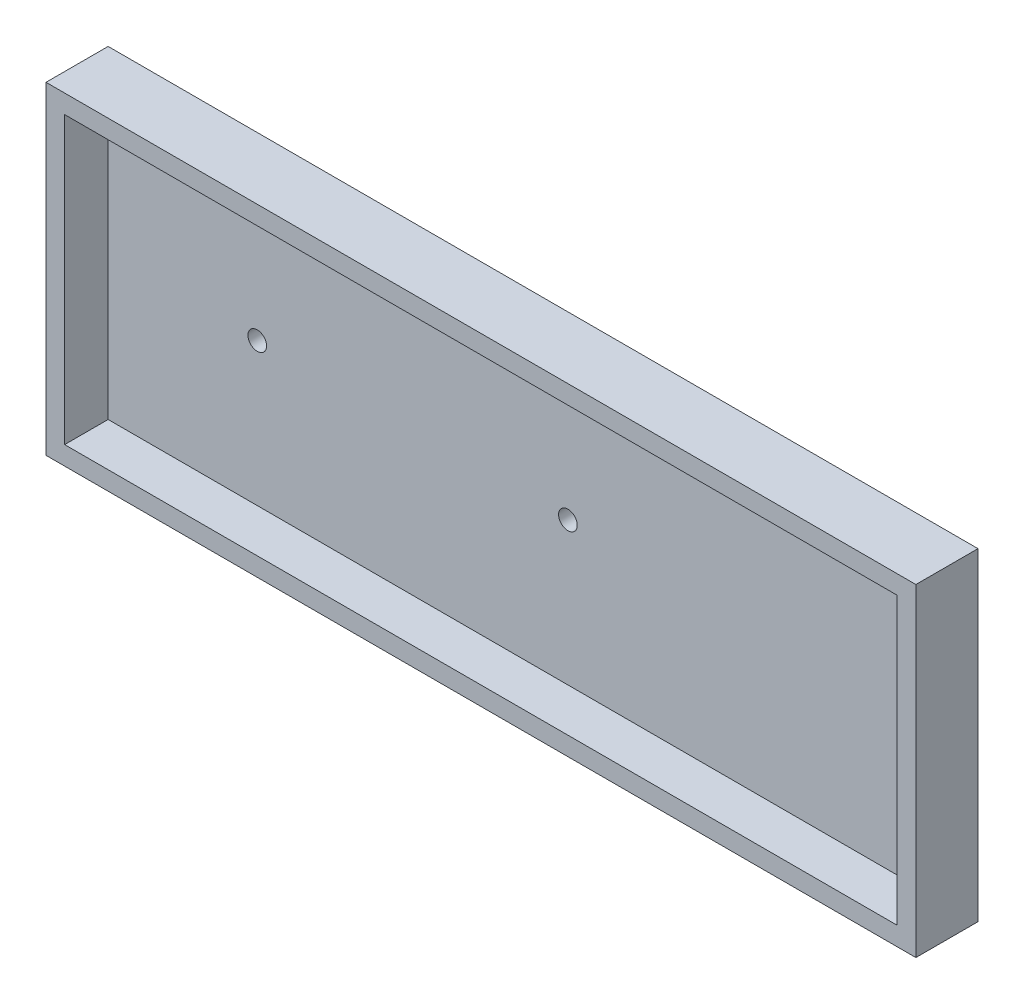
ISO-10303-21;
HEADER;
FILE_DESCRIPTION(('STEP AP214'),'2;1');
FILE_NAME('part.step','',(''),(''),'','','');
FILE_SCHEMA(('AUTOMOTIVE_DESIGN { 1 0 10303 214 1 1 1 1 }'));
ENDSEC;
DATA;
#1=APPLICATION_CONTEXT('core data for automotive mechanical design processes');
#2=APPLICATION_PROTOCOL_DEFINITION('international standard','automotive_design',2000,#1);
#3=PRODUCT_CONTEXT('',#1,'mechanical');
#4=PRODUCT('Part','Part','',(#3));
#5=PRODUCT_RELATED_PRODUCT_CATEGORY('part','',(#4));
#6=PRODUCT_DEFINITION_FORMATION('','',#4);
#7=PRODUCT_DEFINITION_CONTEXT('part definition',#1,'design');
#8=PRODUCT_DEFINITION('design','',#6,#7);
#9=PRODUCT_DEFINITION_SHAPE('','',#8);
#10=(LENGTH_UNIT() NAMED_UNIT(*) SI_UNIT(.MILLI.,.METRE.));
#11=(NAMED_UNIT(*) PLANE_ANGLE_UNIT() SI_UNIT($,.RADIAN.));
#12=(NAMED_UNIT(*) SI_UNIT($,.STERADIAN.) SOLID_ANGLE_UNIT());
#13=UNCERTAINTY_MEASURE_WITH_UNIT(LENGTH_MEASURE(1.E-05),#10,'distance_accuracy_value','');
#14=(GEOMETRIC_REPRESENTATION_CONTEXT(3) GLOBAL_UNCERTAINTY_ASSIGNED_CONTEXT((#13)) GLOBAL_UNIT_ASSIGNED_CONTEXT((#10,
#11,#12)) REPRESENTATION_CONTEXT('',''));
#15=CARTESIAN_POINT('',(0.,0.,0.));
#16=DIRECTION('',(0.,0.,1.));
#17=DIRECTION('',(1.,0.,0.));
#18=AXIS2_PLACEMENT_3D('',#15,#16,#17);
#19=CARTESIAN_POINT('',(0.,0.,5.));
#20=DIRECTION('',(0.,0.,-1.));
#21=DIRECTION('',(-1.,0.,0.));
#22=AXIS2_PLACEMENT_3D('',#19,#20,#21);
#23=PLANE('',#22);
#24=DIRECTION('',(0.,1.,0.));
#25=VECTOR('',#24,1.);
#26=CARTESIAN_POINT('',(35.,-13.,5.));
#27=LINE('',#26,#25);
#28=CARTESIAN_POINT('',(35.,-13.,5.));
#29=VERTEX_POINT('',#28);
#30=CARTESIAN_POINT('',(35.,13.,5.));
#31=VERTEX_POINT('',#30);
#32=EDGE_CURVE('E157',#29,#31,#27,.T.);
#33=ORIENTED_EDGE('',*,*,#32,.T.);
#34=DIRECTION('',(-1.,0.,0.));
#35=VECTOR('',#34,1.);
#36=CARTESIAN_POINT('',(-35.,13.,5.));
#37=LINE('',#36,#35);
#38=CARTESIAN_POINT('',(-35.,13.,5.));
#39=VERTEX_POINT('',#38);
#40=EDGE_CURVE('E92',#31,#39,#37,.T.);
#41=ORIENTED_EDGE('',*,*,#40,.T.);
#42=DIRECTION('',(0.,-1.,0.));
#43=VECTOR('',#42,1.);
#44=CARTESIAN_POINT('',(-35.,-13.,5.));
#45=LINE('',#44,#43);
#46=CARTESIAN_POINT('',(-35.,-13.,5.));
#47=VERTEX_POINT('',#46);
#48=EDGE_CURVE('E162',#39,#47,#45,.T.);
#49=ORIENTED_EDGE('',*,*,#48,.T.);
#50=DIRECTION('',(1.,0.,0.));
#51=VECTOR('',#50,1.);
#52=CARTESIAN_POINT('',(-35.,-13.,5.));
#53=LINE('',#52,#51);
#54=EDGE_CURVE('E64',#47,#29,#53,.T.);
#55=ORIENTED_EDGE('',*,*,#54,.T.);
#56=EDGE_LOOP('',(#33,#41,#49,#55));
#57=FACE_BOUND('',#56,.T.);
#58=DIRECTION('',(0.,1.,0.));
#59=VECTOR('',#58,1.);
#60=CARTESIAN_POINT('',(33.5,0.,5.));
#61=LINE('',#60,#59);
#62=CARTESIAN_POINT('',(33.5,-11.5,5.));
#63=VERTEX_POINT('',#62);
#64=CARTESIAN_POINT('',(33.5,11.5,5.));
#65=VERTEX_POINT('',#64);
#66=EDGE_CURVE('E141',#63,#65,#61,.T.);
#67=ORIENTED_EDGE('',*,*,#66,.F.);
#68=DIRECTION('',(1.,0.,0.));
#69=VECTOR('',#68,1.);
#70=CARTESIAN_POINT('',(0.,-11.5,5.));
#71=LINE('',#70,#69);
#72=CARTESIAN_POINT('',(-33.5,-11.5,5.));
#73=VERTEX_POINT('',#72);
#74=EDGE_CURVE('E154',#73,#63,#71,.T.);
#75=ORIENTED_EDGE('',*,*,#74,.F.);
#76=DIRECTION('',(0.,-1.,0.));
#77=VECTOR('',#76,1.);
#78=CARTESIAN_POINT('',(-33.5,0.,5.));
#79=LINE('',#78,#77);
#80=CARTESIAN_POINT('',(-33.5,11.5,5.));
#81=VERTEX_POINT('',#80);
#82=EDGE_CURVE('E151',#81,#73,#79,.T.);
#83=ORIENTED_EDGE('',*,*,#82,.F.);
#84=DIRECTION('',(-1.,0.,0.));
#85=VECTOR('',#84,1.);
#86=CARTESIAN_POINT('',(0.,11.5,5.));
#87=LINE('',#86,#85);
#88=EDGE_CURVE('E130',#65,#81,#87,.T.);
#89=ORIENTED_EDGE('',*,*,#88,.F.);
#90=EDGE_LOOP('',(#67,#75,#83,#89));
#91=FACE_BOUND('',#90,.T.);
#92=ADVANCED_FACE('F39',(#57,#91),#23,.F.);
#93=CARTESIAN_POINT('',(35.,-13.,5.));
#94=DIRECTION('',(-1.,0.,0.));
#95=DIRECTION('',(0.,0.,1.));
#96=AXIS2_PLACEMENT_3D('',#93,#94,#95);
#97=PLANE('',#96);
#98=DIRECTION('',(0.,1.,0.));
#99=VECTOR('',#98,1.);
#100=CARTESIAN_POINT('',(35.,-13.,0.));
#101=LINE('',#100,#99);
#102=CARTESIAN_POINT('',(35.,-13.,0.));
#103=VERTEX_POINT('',#102);
#104=CARTESIAN_POINT('',(35.,13.,0.));
#105=VERTEX_POINT('',#104);
#106=EDGE_CURVE('E168',#103,#105,#101,.T.);
#107=ORIENTED_EDGE('',*,*,#106,.T.);
#108=DIRECTION('',(0.,0.,-1.));
#109=VECTOR('',#108,1.);
#110=CARTESIAN_POINT('',(35.,13.,5.));
#111=LINE('',#110,#109);
#112=EDGE_CURVE('E11',#31,#105,#111,.T.);
#113=ORIENTED_EDGE('',*,*,#112,.F.);
#114=ORIENTED_EDGE('',*,*,#32,.F.);
#115=DIRECTION('',(0.,0.,-1.));
#116=VECTOR('',#115,1.);
#117=CARTESIAN_POINT('',(35.,-13.,5.));
#118=LINE('',#117,#116);
#119=EDGE_CURVE('E167',#29,#103,#118,.T.);
#120=ORIENTED_EDGE('',*,*,#119,.T.);
#121=EDGE_LOOP('',(#107,#113,#114,#120));
#122=FACE_BOUND('',#121,.T.);
#123=ADVANCED_FACE('F41',(#122),#97,.F.);
#124=CARTESIAN_POINT('',(-35.,13.,5.));
#125=DIRECTION('',(0.,-1.,0.));
#126=DIRECTION('',(0.,0.,-1.));
#127=AXIS2_PLACEMENT_3D('',#124,#125,#126);
#128=PLANE('',#127);
#129=DIRECTION('',(-1.,0.,0.));
#130=VECTOR('',#129,1.);
#131=CARTESIAN_POINT('',(-35.,13.,0.));
#132=LINE('',#131,#130);
#133=CARTESIAN_POINT('',(-35.,13.,0.));
#134=VERTEX_POINT('',#133);
#135=EDGE_CURVE('E172',#105,#134,#132,.T.);
#136=ORIENTED_EDGE('',*,*,#135,.T.);
#137=DIRECTION('',(0.,0.,-1.));
#138=VECTOR('',#137,1.);
#139=CARTESIAN_POINT('',(-35.,13.,5.));
#140=LINE('',#139,#138);
#141=EDGE_CURVE('E48',#39,#134,#140,.T.);
#142=ORIENTED_EDGE('',*,*,#141,.F.);
#143=ORIENTED_EDGE('',*,*,#40,.F.);
#144=ORIENTED_EDGE('',*,*,#112,.T.);
#145=EDGE_LOOP('',(#136,#142,#143,#144));
#146=FACE_BOUND('',#145,.T.);
#147=ADVANCED_FACE('F207',(#146),#128,.F.);
#148=CARTESIAN_POINT('',(-35.,-13.,5.));
#149=DIRECTION('',(1.,0.,0.));
#150=DIRECTION('',(0.,0.,-1.));
#151=AXIS2_PLACEMENT_3D('',#148,#149,#150);
#152=PLANE('',#151);
#153=DIRECTION('',(0.,-1.,0.));
#154=VECTOR('',#153,1.);
#155=CARTESIAN_POINT('',(-35.,-13.,0.));
#156=LINE('',#155,#154);
#157=CARTESIAN_POINT('',(-35.,-13.,0.));
#158=VERTEX_POINT('',#157);
#159=EDGE_CURVE('E175',#134,#158,#156,.T.);
#160=ORIENTED_EDGE('',*,*,#159,.T.);
#161=DIRECTION('',(0.,0.,-1.));
#162=VECTOR('',#161,1.);
#163=CARTESIAN_POINT('',(-35.,-13.,5.));
#164=LINE('',#163,#162);
#165=EDGE_CURVE('E182',#47,#158,#164,.T.);
#166=ORIENTED_EDGE('',*,*,#165,.F.);
#167=ORIENTED_EDGE('',*,*,#48,.F.);
#168=ORIENTED_EDGE('',*,*,#141,.T.);
#169=EDGE_LOOP('',(#160,#166,#167,#168));
#170=FACE_BOUND('',#169,.T.);
#171=ADVANCED_FACE('F189',(#170),#152,.F.);
#172=CARTESIAN_POINT('',(-35.,-13.,5.));
#173=DIRECTION('',(0.,1.,0.));
#174=DIRECTION('',(0.,0.,1.));
#175=AXIS2_PLACEMENT_3D('',#172,#173,#174);
#176=PLANE('',#175);
#177=DIRECTION('',(1.,0.,0.));
#178=VECTOR('',#177,1.);
#179=CARTESIAN_POINT('',(-35.,-13.,0.));
#180=LINE('',#179,#178);
#181=EDGE_CURVE('E85',#158,#103,#180,.T.);
#182=ORIENTED_EDGE('',*,*,#181,.T.);
#183=ORIENTED_EDGE('',*,*,#119,.F.);
#184=ORIENTED_EDGE('',*,*,#54,.F.);
#185=ORIENTED_EDGE('',*,*,#165,.T.);
#186=EDGE_LOOP('',(#182,#183,#184,#185));
#187=FACE_BOUND('',#186,.T.);
#188=ADVANCED_FACE('F197',(#187),#176,.F.);
#189=CARTESIAN_POINT('',(0.,0.,0.));
#190=DIRECTION('',(0.,0.,-1.));
#191=DIRECTION('',(-1.,0.,0.));
#192=AXIS2_PLACEMENT_3D('',#189,#190,#191);
#193=PLANE('',#192);
#194=CARTESIAN_POINT('',(-21.5,0.,0.));
#195=DIRECTION('',(0.,0.,1.));
#196=DIRECTION('',(1.,0.,0.));
#197=AXIS2_PLACEMENT_3D('',#194,#195,#196);
#198=CIRCLE('',#197,0.750000000000002);
#199=CARTESIAN_POINT('',(-20.75,0.,0.));
#200=VERTEX_POINT('',#199);
#201=EDGE_CURVE('E241',#200,#200,#198,.T.);
#202=ORIENTED_EDGE('',*,*,#201,.T.);
#203=EDGE_LOOP('',(#202));
#204=FACE_BOUND('',#203,.T.);
#205=CARTESIAN_POINT('',(3.50000000000001,0.,0.));
#206=DIRECTION('',(0.,0.,1.));
#207=DIRECTION('',(1.,0.,0.));
#208=AXIS2_PLACEMENT_3D('',#205,#206,#207);
#209=CIRCLE('',#208,0.75);
#210=CARTESIAN_POINT('',(4.25000000000001,0.,0.));
#211=VERTEX_POINT('',#210);
#212=EDGE_CURVE('E246',#211,#211,#209,.T.);
#213=ORIENTED_EDGE('',*,*,#212,.T.);
#214=EDGE_LOOP('',(#213));
#215=FACE_BOUND('',#214,.T.);
#216=ORIENTED_EDGE('',*,*,#106,.F.);
#217=ORIENTED_EDGE('',*,*,#181,.F.);
#218=ORIENTED_EDGE('',*,*,#159,.F.);
#219=ORIENTED_EDGE('',*,*,#135,.F.);
#220=EDGE_LOOP('',(#216,#217,#218,#219));
#221=FACE_BOUND('',#220,.T.);
#222=ADVANCED_FACE('F193',(#204,#215,#221),#193,.T.);
#223=CARTESIAN_POINT('',(33.5,-13.,5.));
#224=DIRECTION('',(-1.,0.,0.));
#225=DIRECTION('',(0.,0.,1.));
#226=AXIS2_PLACEMENT_3D('',#223,#224,#225);
#227=PLANE('',#226);
#228=DIRECTION('',(0.,1.,0.));
#229=VECTOR('',#228,1.);
#230=CARTESIAN_POINT('',(33.5,0.,1.5));
#231=LINE('',#230,#229);
#232=CARTESIAN_POINT('',(33.5,-11.5,1.5));
#233=VERTEX_POINT('',#232);
#234=CARTESIAN_POINT('',(33.5,11.5,1.5));
#235=VERTEX_POINT('',#234);
#236=EDGE_CURVE('E120',#233,#235,#231,.T.);
#237=ORIENTED_EDGE('',*,*,#236,.F.);
#238=DIRECTION('',(0.,0.,-1.));
#239=VECTOR('',#238,1.);
#240=CARTESIAN_POINT('',(33.5,-11.5,5.));
#241=LINE('',#240,#239);
#242=EDGE_CURVE('E145',#63,#233,#241,.T.);
#243=ORIENTED_EDGE('',*,*,#242,.F.);
#244=ORIENTED_EDGE('',*,*,#66,.T.);
#245=DIRECTION('',(0.,0.,-1.));
#246=VECTOR('',#245,1.);
#247=CARTESIAN_POINT('',(33.5,11.5,5.));
#248=LINE('',#247,#246);
#249=EDGE_CURVE('E134',#65,#235,#248,.T.);
#250=ORIENTED_EDGE('',*,*,#249,.T.);
#251=EDGE_LOOP('',(#237,#243,#244,#250));
#252=FACE_BOUND('',#251,.T.);
#253=ADVANCED_FACE('F204',(#252),#227,.T.);
#254=CARTESIAN_POINT('',(-35.,11.5,5.));
#255=DIRECTION('',(0.,-1.,0.));
#256=DIRECTION('',(0.,0.,-1.));
#257=AXIS2_PLACEMENT_3D('',#254,#255,#256);
#258=PLANE('',#257);
#259=DIRECTION('',(-1.,0.,0.));
#260=VECTOR('',#259,1.);
#261=CARTESIAN_POINT('',(0.,11.5,1.5));
#262=LINE('',#261,#260);
#263=CARTESIAN_POINT('',(-33.5,11.5,1.5));
#264=VERTEX_POINT('',#263);
#265=EDGE_CURVE('E114',#235,#264,#262,.T.);
#266=ORIENTED_EDGE('',*,*,#265,.F.);
#267=ORIENTED_EDGE('',*,*,#249,.F.);
#268=ORIENTED_EDGE('',*,*,#88,.T.);
#269=DIRECTION('',(0.,0.,-1.));
#270=VECTOR('',#269,1.);
#271=CARTESIAN_POINT('',(-33.5,11.5,5.));
#272=LINE('',#271,#270);
#273=EDGE_CURVE('E127',#81,#264,#272,.T.);
#274=ORIENTED_EDGE('',*,*,#273,.T.);
#275=EDGE_LOOP('',(#266,#267,#268,#274));
#276=FACE_BOUND('',#275,.T.);
#277=ADVANCED_FACE('F128',(#276),#258,.T.);
#278=CARTESIAN_POINT('',(-33.5,-13.,5.));
#279=DIRECTION('',(1.,0.,0.));
#280=DIRECTION('',(0.,0.,-1.));
#281=AXIS2_PLACEMENT_3D('',#278,#279,#280);
#282=PLANE('',#281);
#283=DIRECTION('',(0.,-1.,0.));
#284=VECTOR('',#283,1.);
#285=CARTESIAN_POINT('',(-33.5,0.,1.5));
#286=LINE('',#285,#284);
#287=CARTESIAN_POINT('',(-33.5,-11.5,1.5));
#288=VERTEX_POINT('',#287);
#289=EDGE_CURVE('E118',#264,#288,#286,.T.);
#290=ORIENTED_EDGE('',*,*,#289,.F.);
#291=ORIENTED_EDGE('',*,*,#273,.F.);
#292=ORIENTED_EDGE('',*,*,#82,.T.);
#293=DIRECTION('',(0.,0.,-1.));
#294=VECTOR('',#293,1.);
#295=CARTESIAN_POINT('',(-33.5,-11.5,5.));
#296=LINE('',#295,#294);
#297=EDGE_CURVE('E55',#73,#288,#296,.T.);
#298=ORIENTED_EDGE('',*,*,#297,.T.);
#299=EDGE_LOOP('',(#290,#291,#292,#298));
#300=FACE_BOUND('',#299,.T.);
#301=ADVANCED_FACE('F136',(#300),#282,.T.);
#302=CARTESIAN_POINT('',(-35.,-11.5,5.));
#303=DIRECTION('',(0.,1.,0.));
#304=DIRECTION('',(0.,0.,1.));
#305=AXIS2_PLACEMENT_3D('',#302,#303,#304);
#306=PLANE('',#305);
#307=DIRECTION('',(1.,0.,0.));
#308=VECTOR('',#307,1.);
#309=CARTESIAN_POINT('',(0.,-11.5,1.5));
#310=LINE('',#309,#308);
#311=EDGE_CURVE('E138',#288,#233,#310,.T.);
#312=ORIENTED_EDGE('',*,*,#311,.F.);
#313=ORIENTED_EDGE('',*,*,#297,.F.);
#314=ORIENTED_EDGE('',*,*,#74,.T.);
#315=ORIENTED_EDGE('',*,*,#242,.T.);
#316=EDGE_LOOP('',(#312,#313,#314,#315));
#317=FACE_BOUND('',#316,.T.);
#318=ADVANCED_FACE('F219',(#317),#306,.T.);
#319=CARTESIAN_POINT('',(0.,0.,1.5));
#320=DIRECTION('',(0.,0.,-1.));
#321=DIRECTION('',(-1.,0.,0.));
#322=AXIS2_PLACEMENT_3D('',#319,#320,#321);
#323=PLANE('',#322);
#324=CARTESIAN_POINT('',(-21.5,0.,1.5));
#325=DIRECTION('',(0.,0.,1.));
#326=DIRECTION('',(1.,0.,0.));
#327=AXIS2_PLACEMENT_3D('',#324,#325,#326);
#328=CIRCLE('',#327,0.750000000000002);
#329=CARTESIAN_POINT('',(-20.75,0.,1.5));
#330=VERTEX_POINT('',#329);
#331=EDGE_CURVE('E244',#330,#330,#328,.T.);
#332=ORIENTED_EDGE('',*,*,#331,.F.);
#333=EDGE_LOOP('',(#332));
#334=FACE_BOUND('',#333,.T.);
#335=CARTESIAN_POINT('',(3.50000000000001,0.,1.5));
#336=DIRECTION('',(0.,0.,1.));
#337=DIRECTION('',(1.,0.,0.));
#338=AXIS2_PLACEMENT_3D('',#335,#336,#337);
#339=CIRCLE('',#338,0.75);
#340=CARTESIAN_POINT('',(4.25000000000001,0.,1.5));
#341=VERTEX_POINT('',#340);
#342=EDGE_CURVE('E252',#341,#341,#339,.T.);
#343=ORIENTED_EDGE('',*,*,#342,.F.);
#344=EDGE_LOOP('',(#343));
#345=FACE_BOUND('',#344,.T.);
#346=ORIENTED_EDGE('',*,*,#236,.T.);
#347=ORIENTED_EDGE('',*,*,#265,.T.);
#348=ORIENTED_EDGE('',*,*,#289,.T.);
#349=ORIENTED_EDGE('',*,*,#311,.T.);
#350=EDGE_LOOP('',(#346,#347,#348,#349));
#351=FACE_BOUND('',#350,.T.);
#352=ADVANCED_FACE('F116',(#334,#345,#351),#323,.F.);
#353=CARTESIAN_POINT('',(3.50000000000001,0.,0.));
#354=DIRECTION('',(0.,0.,1.));
#355=DIRECTION('',(1.,0.,0.));
#356=AXIS2_PLACEMENT_3D('',#353,#354,#355);
#357=CYLINDRICAL_SURFACE('',#356,0.75);
#358=ORIENTED_EDGE('',*,*,#212,.F.);
#359=EDGE_LOOP('',(#358));
#360=FACE_BOUND('',#359,.T.);
#361=ORIENTED_EDGE('',*,*,#342,.T.);
#362=EDGE_LOOP('',(#361));
#363=FACE_BOUND('',#362,.T.);
#364=ADVANCED_FACE('F218',(#360,#363),#357,.F.);
#365=CARTESIAN_POINT('',(-21.5,0.,0.));
#366=DIRECTION('',(0.,0.,1.));
#367=DIRECTION('',(1.,0.,0.));
#368=AXIS2_PLACEMENT_3D('',#365,#366,#367);
#369=CYLINDRICAL_SURFACE('',#368,0.750000000000002);
#370=ORIENTED_EDGE('',*,*,#201,.F.);
#371=EDGE_LOOP('',(#370));
#372=FACE_BOUND('',#371,.T.);
#373=ORIENTED_EDGE('',*,*,#331,.T.);
#374=EDGE_LOOP('',(#373));
#375=FACE_BOUND('',#374,.T.);
#376=ADVANCED_FACE('F232',(#372,#375),#369,.F.);
#377=CLOSED_SHELL('',(#92,#123,#147,#171,#188,#222,#253,#277,#301,#318,#352,#364,#376));
#378=MANIFOLD_SOLID_BREP('B2',#377);
#379=ADVANCED_BREP_SHAPE_REPRESENTATION('',(#18,#378),#14);
#380=SHAPE_DEFINITION_REPRESENTATION(#9,#379);
ENDSEC;
END-ISO-10303-21;
